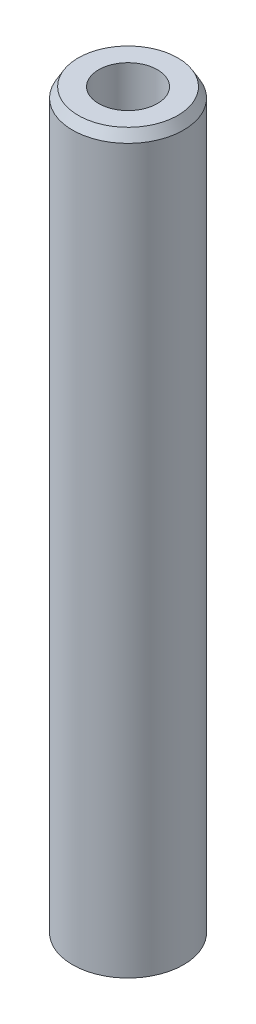
ISO-10303-21;
HEADER;
FILE_DESCRIPTION(('STEP AP214'),'2;1');
FILE_NAME('part.step','',(''),(''),'','','');
FILE_SCHEMA(('AUTOMOTIVE_DESIGN { 1 0 10303 214 1 1 1 1 }'));
ENDSEC;
DATA;
#1=APPLICATION_CONTEXT('core data for automotive mechanical design processes');
#2=APPLICATION_PROTOCOL_DEFINITION('international standard','automotive_design',2000,#1);
#3=PRODUCT_CONTEXT('',#1,'mechanical');
#4=PRODUCT('Part','Part','',(#3));
#5=PRODUCT_RELATED_PRODUCT_CATEGORY('part','',(#4));
#6=PRODUCT_DEFINITION_FORMATION('','',#4);
#7=PRODUCT_DEFINITION_CONTEXT('part definition',#1,'design');
#8=PRODUCT_DEFINITION('design','',#6,#7);
#9=PRODUCT_DEFINITION_SHAPE('','',#8);
#10=(LENGTH_UNIT() NAMED_UNIT(*) SI_UNIT(.MILLI.,.METRE.));
#11=(NAMED_UNIT(*) PLANE_ANGLE_UNIT() SI_UNIT($,.RADIAN.));
#12=(NAMED_UNIT(*) SI_UNIT($,.STERADIAN.) SOLID_ANGLE_UNIT());
#13=UNCERTAINTY_MEASURE_WITH_UNIT(LENGTH_MEASURE(1.E-05),#10,'distance_accuracy_value','');
#14=(GEOMETRIC_REPRESENTATION_CONTEXT(3) GLOBAL_UNCERTAINTY_ASSIGNED_CONTEXT((#13)) GLOBAL_UNIT_ASSIGNED_CONTEXT((#10,
#11,#12)) REPRESENTATION_CONTEXT('',''));
#15=CARTESIAN_POINT('',(0.,0.,0.));
#16=DIRECTION('',(0.,0.,1.));
#17=DIRECTION('',(1.,0.,0.));
#18=AXIS2_PLACEMENT_3D('',#15,#16,#17);
#19=CARTESIAN_POINT('',(0.,66.4861618181915,0.));
#20=DIRECTION('',(0.,-1.,0.));
#21=DIRECTION('',(0.,0.,-1.));
#22=AXIS2_PLACEMENT_3D('',#19,#20,#21);
#23=CYLINDRICAL_SURFACE('',#22,5.);
#24=CARTESIAN_POINT('',(0.,65.5954104036297,0.));
#25=DIRECTION('',(0.,1.,0.));
#26=DIRECTION('',(0.,0.,1.));
#27=AXIS2_PLACEMENT_3D('',#24,#25,#26);
#28=CIRCLE('',#27,5.);
#29=CARTESIAN_POINT('',(0.,65.5954104036297,-5.));
#30=VERTEX_POINT('',#29);
#31=EDGE_CURVE('E50',#30,#30,#28,.F.);
#32=ORIENTED_EDGE('',*,*,#31,.T.);
#33=EDGE_LOOP('',(#32));
#34=FACE_BOUND('',#33,.T.);
#35=CARTESIAN_POINT('',(0.,0.51427556897829,0.));
#36=DIRECTION('',(0.,1.,0.));
#37=DIRECTION('',(0.,0.,1.));
#38=AXIS2_PLACEMENT_3D('',#35,#36,#37);
#39=CIRCLE('',#38,5.);
#40=CARTESIAN_POINT('',(0.,0.51427556897829,5.));
#41=VERTEX_POINT('',#40);
#42=EDGE_CURVE('E51',#41,#41,#39,.T.);
#43=ORIENTED_EDGE('',*,*,#42,.T.);
#44=EDGE_LOOP('',(#43));
#45=FACE_BOUND('',#44,.T.);
#46=ADVANCED_FACE('F39',(#34,#45),#23,.T.);
#47=CARTESIAN_POINT('',(0.,66.4861618181915,0.));
#48=DIRECTION('',(0.,1.,0.));
#49=DIRECTION('',(0.,0.,1.));
#50=AXIS2_PLACEMENT_3D('',#47,#48,#49);
#51=PLANE('',#50);
#52=CARTESIAN_POINT('',(0.,66.4861618181915,0.));
#53=DIRECTION('',(0.,1.,0.));
#54=DIRECTION('',(0.,0.,1.));
#55=AXIS2_PLACEMENT_3D('',#52,#53,#54);
#56=CIRCLE('',#55,4.48572443102172);
#57=CARTESIAN_POINT('',(0.,66.4861618181915,-4.48572443102173));
#58=VERTEX_POINT('',#57);
#59=EDGE_CURVE('E54',#58,#58,#56,.T.);
#60=ORIENTED_EDGE('',*,*,#59,.T.);
#61=EDGE_LOOP('',(#60));
#62=FACE_BOUND('',#61,.T.);
#63=CARTESIAN_POINT('',(0.,66.4861618181915,0.));
#64=DIRECTION('',(0.,1.,0.));
#65=DIRECTION('',(0.,0.,1.));
#66=AXIS2_PLACEMENT_3D('',#63,#64,#65);
#67=CIRCLE('',#66,2.64390287306598);
#68=CARTESIAN_POINT('',(0.,66.4861618181915,2.64390287306598));
#69=VERTEX_POINT('',#68);
#70=EDGE_CURVE('E58',#69,#69,#67,.T.);
#71=ORIENTED_EDGE('',*,*,#70,.F.);
#72=EDGE_LOOP('',(#71));
#73=FACE_BOUND('',#72,.T.);
#74=ADVANCED_FACE('F69',(#62,#73),#51,.T.);
#75=CARTESIAN_POINT('',(0.,0.,0.));
#76=DIRECTION('',(0.,1.,0.));
#77=DIRECTION('',(0.,0.,1.));
#78=AXIS2_PLACEMENT_3D('',#75,#76,#77);
#79=PLANE('',#78);
#80=CARTESIAN_POINT('',(0.,0.,0.));
#81=DIRECTION('',(0.,1.,0.));
#82=DIRECTION('',(0.,0.,1.));
#83=AXIS2_PLACEMENT_3D('',#80,#81,#82);
#84=CIRCLE('',#83,4.10924858543819);
#85=CARTESIAN_POINT('',(0.,0.,4.10924858543819));
#86=VERTEX_POINT('',#85);
#87=EDGE_CURVE('E10',#86,#86,#84,.F.);
#88=ORIENTED_EDGE('',*,*,#87,.T.);
#89=EDGE_LOOP('',(#88));
#90=FACE_BOUND('',#89,.T.);
#91=CARTESIAN_POINT('',(0.,0.,0.));
#92=DIRECTION('',(0.,1.,0.));
#93=DIRECTION('',(0.,0.,1.));
#94=AXIS2_PLACEMENT_3D('',#91,#92,#93);
#95=CIRCLE('',#94,2.64390287306598);
#96=CARTESIAN_POINT('',(0.,0.,2.64390287306598));
#97=VERTEX_POINT('',#96);
#98=EDGE_CURVE('E63',#97,#97,#95,.T.);
#99=ORIENTED_EDGE('',*,*,#98,.T.);
#100=EDGE_LOOP('',(#99));
#101=FACE_BOUND('',#100,.T.);
#102=ADVANCED_FACE('F75',(#90,#101),#79,.F.);
#103=CARTESIAN_POINT('',(0.,66.4861618181915,0.));
#104=DIRECTION('',(0.,-1.,0.));
#105=DIRECTION('',(0.,0.,-1.));
#106=AXIS2_PLACEMENT_3D('',#103,#104,#105);
#107=CYLINDRICAL_SURFACE('',#106,2.64390287306598);
#108=ORIENTED_EDGE('',*,*,#70,.T.);
#109=EDGE_LOOP('',(#108));
#110=FACE_BOUND('',#109,.T.);
#111=ORIENTED_EDGE('',*,*,#98,.F.);
#112=EDGE_LOOP('',(#111));
#113=FACE_BOUND('',#112,.T.);
#114=ADVANCED_FACE('F70',(#110,#113),#107,.F.);
#115=CARTESIAN_POINT('',(0.,66.4861618181915,0.));
#116=DIRECTION('',(0.,-1.,0.));
#117=DIRECTION('',(0.,0.,-1.));
#118=AXIS2_PLACEMENT_3D('',#115,#116,#117);
#119=CONICAL_SURFACE('',#118,4.48572443102172,0.523598775598286);
#120=CARTESIAN_POINT('',(0.,65.5954104036297,-5.));
#121=CARTESIAN_POINT('',(0.,65.6046890641981,-4.99464296282315));
#122=CARTESIAN_POINT('',(0.,65.6139677247665,-4.98928592564629));
#123=CARTESIAN_POINT('',(0.,65.6325250459032,-4.97857185129258));
#124=CARTESIAN_POINT('',(0.,65.6418037064715,-4.97321481411572));
#125=CARTESIAN_POINT('',(0.,65.6603610276082,-4.962500739762));
#126=CARTESIAN_POINT('',(0.,65.6696396881766,-4.95714370258515));
#127=CARTESIAN_POINT('',(0.,65.6881970093133,-4.94642962823143));
#128=CARTESIAN_POINT('',(0.,65.6974756698816,-4.94107259105458));
#129=CARTESIAN_POINT('',(0.,65.7160329910183,-4.93035851670086));
#130=CARTESIAN_POINT('',(0.,65.7253116515867,-4.92500147952401));
#131=CARTESIAN_POINT('',(0.,65.7438689727234,-4.91428740517029));
#132=CARTESIAN_POINT('',(0.,65.7531476332917,-4.90893036799343));
#133=CARTESIAN_POINT('',(0.,65.7717049544284,-4.89821629363972));
#134=CARTESIAN_POINT('',(0.,65.7809836149968,-4.89285925646286));
#135=CARTESIAN_POINT('',(0.,65.7995409361335,-4.88214518210915));
#136=CARTESIAN_POINT('',(0.,65.8088195967019,-4.87678814493229));
#137=CARTESIAN_POINT('',(0.,65.8273769178385,-4.86607407057858));
#138=CARTESIAN_POINT('',(0.,65.8366555784069,-4.86071703340172));
#139=CARTESIAN_POINT('',(0.,65.8552128995436,-4.85000295904801));
#140=CARTESIAN_POINT('',(0.,65.864491560112,-4.84464592187115));
#141=CARTESIAN_POINT('',(0.,65.8830488812487,-4.83393184751744));
#142=CARTESIAN_POINT('',(0.,65.892327541817,-4.82857481034058));
#143=CARTESIAN_POINT('',(0.,65.9108848629537,-4.81786073598686));
#144=CARTESIAN_POINT('',(0.,65.9201635235221,-4.81250369881001));
#145=CARTESIAN_POINT('',(0.,65.9387208446588,-4.80178962445629));
#146=CARTESIAN_POINT('',(0.,65.9479995052271,-4.79643258727944));
#147=CARTESIAN_POINT('',(0.,65.9665568263638,-4.78571851292572));
#148=CARTESIAN_POINT('',(0.,65.9758354869322,-4.78036147574886));
#149=CARTESIAN_POINT('',(0.,65.9943928080689,-4.76964740139515));
#150=CARTESIAN_POINT('',(0.,66.0036714686372,-4.76429036421829));
#151=CARTESIAN_POINT('',(0.,66.0222287897739,-4.75357628986458));
#152=CARTESIAN_POINT('',(0.,66.0315074503423,-4.74821925268772));
#153=CARTESIAN_POINT('',(0.,66.050064771479,-4.73750517833401));
#154=CARTESIAN_POINT('',(0.,66.0593434320473,-4.73214814115715));
#155=CARTESIAN_POINT('',(0.,66.0779007531841,-4.72143406680344));
#156=CARTESIAN_POINT('',(0.,66.0871794137524,-4.71607702962658));
#157=CARTESIAN_POINT('',(0.,66.1057367348891,-4.70536295527287));
#158=CARTESIAN_POINT('',(0.,66.1150153954575,-4.70000591809601));
#159=CARTESIAN_POINT('',(0.,66.1335727165942,-4.68929184374229));
#160=CARTESIAN_POINT('',(0.,66.1428513771625,-4.68393480656544));
#161=CARTESIAN_POINT('',(0.,66.1614086982992,-4.67322073221172));
#162=CARTESIAN_POINT('',(0.,66.1706873588676,-4.66786369503487));
#163=CARTESIAN_POINT('',(0.,66.1892446800043,-4.65714962068115));
#164=CARTESIAN_POINT('',(0.,66.1985233405726,-4.6517925835043));
#165=CARTESIAN_POINT('',(0.,66.2170806617093,-4.64107850915058));
#166=CARTESIAN_POINT('',(0.,66.2263593222777,-4.63572147197372));
#167=CARTESIAN_POINT('',(0.,66.2449166434144,-4.62500739762001));
#168=CARTESIAN_POINT('',(0.,66.2541953039827,-4.61965036044315));
#169=CARTESIAN_POINT('',(0.,66.2727526251195,-4.60893628608944));
#170=CARTESIAN_POINT('',(0.,66.2820312856878,-4.60357924891258));
#171=CARTESIAN_POINT('',(0.,66.3005886068245,-4.59286517455887));
#172=CARTESIAN_POINT('',(0.,66.3098672673928,-4.58750813738201));
#173=CARTESIAN_POINT('',(0.,66.3284245885296,-4.5767940630283));
#174=CARTESIAN_POINT('',(0.,66.3377032490979,-4.57143702585144));
#175=CARTESIAN_POINT('',(0.,66.3562605702346,-4.56072295149773));
#176=CARTESIAN_POINT('',(0.,66.365539230803,-4.55536591432087));
#177=CARTESIAN_POINT('',(0.,66.3840965519397,-4.54465183996715));
#178=CARTESIAN_POINT('',(0.,66.393375212508,-4.5392948027903));
#179=CARTESIAN_POINT('',(0.,66.4119325336447,-4.52858072843658));
#180=CARTESIAN_POINT('',(0.,66.4212111942131,-4.52322369125973));
#181=CARTESIAN_POINT('',(0.,66.4397685153498,-4.51250961690601));
#182=CARTESIAN_POINT('',(0.,66.4490471759181,-4.50715257972915));
#183=CARTESIAN_POINT('',(0.,66.4676044970548,-4.49643850537544));
#184=CARTESIAN_POINT('',(0.,66.4768831576232,-4.49108146819858));
#185=CARTESIAN_POINT('',(0.,66.4861618181915,-4.48572443102173));
#186=B_SPLINE_CURVE_WITH_KNOTS('',3,(#120,#121,#122,#123,#124,#125,#126,#127,#128,#129,#130,
#131,#132,#133,#134,#135,#136,#137,#138,#139,#140,#141,#142,#143,#144,#145,#146,#147,#148,#149,
#150,#151,#152,#153,#154,#155,#156,#157,#158,#159,#160,#161,#162,#163,#164,#165,#166,#167,#168,
#169,#170,#171,#172,#173,#174,#175,#176,#177,#178,#179,#180,#181,#182,#183,#184,#185),
.UNSPECIFIED.,.F.,.F.,(4,2,2,2,2,2,2,2,2,2,2,2,2,2,2,2,2,2,2,2,2,2,2,2,2,2,2,2,2,2,2,2,4),(0.,
0.0321422230611418,0.0642844461222836,0.0964266691834249,0.128568892244567,0.160711115305708,
0.19285333836685,0.224995561427992,0.257137784489145,0.289280007550287,0.321422230611428,
0.35356445367257,0.385706676733712,0.417848899794853,0.449991122855995,0.482133345917136,
0.51427556897829,0.546417792039431,0.578560015100573,0.610702238161715,0.642844461222856,
0.674986684283998,0.70712890734514,0.739271130406281,0.771413353467435,0.803555576528577,
0.835697799589718,0.86784002265086,0.899982245712002,0.932124468773143,0.964266691834285,
0.996408914895426,1.02855113795658),.UNSPECIFIED.);
#187=EDGE_CURVE('BSEAM81',#30,#58,#186,.T.);
#188=ORIENTED_EDGE('',*,*,#31,.F.);
#189=ORIENTED_EDGE('',*,*,#59,.F.);
#190=ORIENTED_EDGE('',*,*,#187,.T.);
#191=ORIENTED_EDGE('',*,*,#187,.F.);
#192=EDGE_LOOP('',(#188,#190,#189,#191));
#193=FACE_BOUND('',#192,.T.);
#194=ADVANCED_FACE('F81',(#193),#119,.T.);
#195=CARTESIAN_POINT('',(0.,0.51427556897829,0.));
#196=DIRECTION('',(0.,1.,0.));
#197=DIRECTION('',(0.,0.,1.));
#198=AXIS2_PLACEMENT_3D('',#195,#196,#197);
#199=CONICAL_SURFACE('',#198,5.,1.04719755119661);
#200=ORIENTED_EDGE('',*,*,#87,.F.);
#201=EDGE_LOOP('',(#200));
#202=FACE_BOUND('',#201,.T.);
#203=ORIENTED_EDGE('',*,*,#42,.F.);
#204=EDGE_LOOP('',(#203));
#205=FACE_BOUND('',#204,.T.);
#206=ADVANCED_FACE('F45',(#202,#205),#199,.T.);
#207=CLOSED_SHELL('',(#46,#74,#102,#114,#194,#206));
#208=MANIFOLD_SOLID_BREP('B2',#207);
#209=ADVANCED_BREP_SHAPE_REPRESENTATION('',(#18,#208),#14);
#210=SHAPE_DEFINITION_REPRESENTATION(#9,#209);
ENDSEC;
END-ISO-10303-21;
